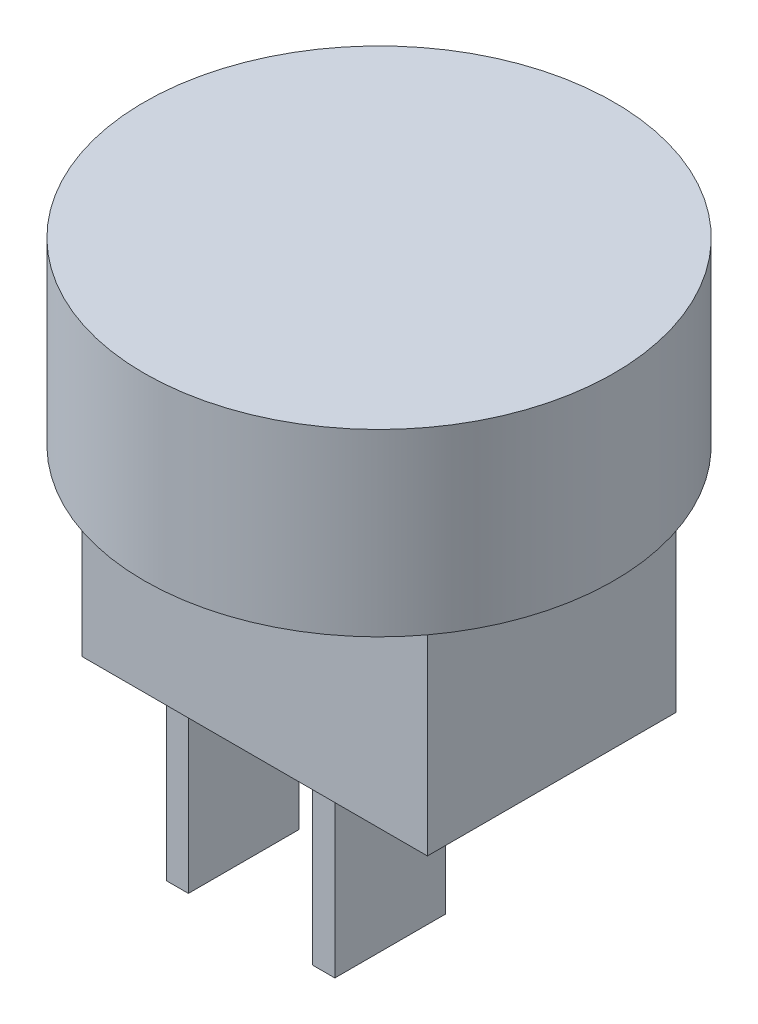
ISO-10303-21;
HEADER;
FILE_DESCRIPTION(('STEP AP214'),'2;1');
FILE_NAME('part.step','',(''),(''),'','','');
FILE_SCHEMA(('AUTOMOTIVE_DESIGN { 1 0 10303 214 1 1 1 1 }'));
ENDSEC;
DATA;
#1=APPLICATION_CONTEXT('core data for automotive mechanical design processes');
#2=APPLICATION_PROTOCOL_DEFINITION('international standard','automotive_design',2000,#1);
#3=PRODUCT_CONTEXT('',#1,'mechanical');
#4=PRODUCT('Part','Part','',(#3));
#5=PRODUCT_RELATED_PRODUCT_CATEGORY('part','',(#4));
#6=PRODUCT_DEFINITION_FORMATION('','',#4);
#7=PRODUCT_DEFINITION_CONTEXT('part definition',#1,'design');
#8=PRODUCT_DEFINITION('design','',#6,#7);
#9=PRODUCT_DEFINITION_SHAPE('','',#8);
#10=(LENGTH_UNIT() NAMED_UNIT(*) SI_UNIT(.MILLI.,.METRE.));
#11=(NAMED_UNIT(*) PLANE_ANGLE_UNIT() SI_UNIT($,.RADIAN.));
#12=(NAMED_UNIT(*) SI_UNIT($,.STERADIAN.) SOLID_ANGLE_UNIT());
#13=UNCERTAINTY_MEASURE_WITH_UNIT(LENGTH_MEASURE(1.E-05),#10,'distance_accuracy_value','');
#14=(GEOMETRIC_REPRESENTATION_CONTEXT(3) GLOBAL_UNCERTAINTY_ASSIGNED_CONTEXT((#13)) GLOBAL_UNIT_ASSIGNED_CONTEXT((#10,
#11,#12)) REPRESENTATION_CONTEXT('',''));
#15=CARTESIAN_POINT('',(0.,0.,0.));
#16=DIRECTION('',(0.,0.,1.));
#17=DIRECTION('',(1.,0.,0.));
#18=AXIS2_PLACEMENT_3D('',#15,#16,#17);
#19=CARTESIAN_POINT('',(0.,0.,0.));
#20=DIRECTION('',(0.,1.,0.));
#21=DIRECTION('',(0.,0.,1.));
#22=AXIS2_PLACEMENT_3D('',#19,#20,#21);
#23=PLANE('',#22);
#24=DIRECTION('',(0.,0.,1.));
#25=VECTOR('',#24,1.);
#26=CARTESIAN_POINT('',(0.4,0.,2.));
#27=LINE('',#26,#25);
#28=CARTESIAN_POINT('',(0.4,0.,-2.));
#29=VERTEX_POINT('',#28);
#30=CARTESIAN_POINT('',(0.4,0.,2.));
#31=VERTEX_POINT('',#30);
#32=EDGE_CURVE('E153',#29,#31,#27,.T.);
#33=ORIENTED_EDGE('',*,*,#32,.F.);
#34=DIRECTION('',(1.,0.,0.));
#35=VECTOR('',#34,1.);
#36=CARTESIAN_POINT('',(-0.4,0.,-2.));
#37=LINE('',#36,#35);
#38=CARTESIAN_POINT('',(-0.4,0.,-2.));
#39=VERTEX_POINT('',#38);
#40=EDGE_CURVE('E169',#39,#29,#37,.T.);
#41=ORIENTED_EDGE('',*,*,#40,.F.);
#42=DIRECTION('',(0.,0.,-1.));
#43=VECTOR('',#42,1.);
#44=CARTESIAN_POINT('',(-0.4,0.,2.));
#45=LINE('',#44,#43);
#46=CARTESIAN_POINT('',(-0.4,0.,2.));
#47=VERTEX_POINT('',#46);
#48=EDGE_CURVE('E182',#47,#39,#45,.T.);
#49=ORIENTED_EDGE('',*,*,#48,.F.);
#50=DIRECTION('',(-1.,0.,0.));
#51=VECTOR('',#50,1.);
#52=CARTESIAN_POINT('',(-0.4,0.,2.));
#53=LINE('',#52,#51);
#54=EDGE_CURVE('E158',#31,#47,#53,.T.);
#55=ORIENTED_EDGE('',*,*,#54,.F.);
#56=EDGE_LOOP('',(#33,#41,#49,#55));
#57=FACE_BOUND('',#56,.T.);
#58=DIRECTION('',(0.,0.,-1.));
#59=VECTOR('',#58,1.);
#60=CARTESIAN_POINT('',(6.25,0.,-4.5));
#61=LINE('',#60,#59);
#62=CARTESIAN_POINT('',(6.25,0.,4.5));
#63=VERTEX_POINT('',#62);
#64=CARTESIAN_POINT('',(6.25,0.,-4.5));
#65=VERTEX_POINT('',#64);
#66=EDGE_CURVE('E209',#63,#65,#61,.T.);
#67=ORIENTED_EDGE('',*,*,#66,.F.);
#68=DIRECTION('',(1.,0.,0.));
#69=VECTOR('',#68,1.);
#70=CARTESIAN_POINT('',(-6.25,0.,4.5));
#71=LINE('',#70,#69);
#72=CARTESIAN_POINT('',(-6.25,0.,4.5));
#73=VERTEX_POINT('',#72);
#74=EDGE_CURVE('E218',#73,#63,#71,.T.);
#75=ORIENTED_EDGE('',*,*,#74,.F.);
#76=DIRECTION('',(0.,0.,1.));
#77=VECTOR('',#76,1.);
#78=CARTESIAN_POINT('',(-6.25,0.,-4.5));
#79=LINE('',#78,#77);
#80=CARTESIAN_POINT('',(-6.25,0.,-4.5));
#81=VERTEX_POINT('',#80);
#82=EDGE_CURVE('E237',#81,#73,#79,.T.);
#83=ORIENTED_EDGE('',*,*,#82,.F.);
#84=DIRECTION('',(-1.,0.,0.));
#85=VECTOR('',#84,1.);
#86=CARTESIAN_POINT('',(-6.25,0.,-4.5));
#87=LINE('',#86,#85);
#88=EDGE_CURVE('E234',#65,#81,#87,.T.);
#89=ORIENTED_EDGE('',*,*,#88,.F.);
#90=EDGE_LOOP('',(#67,#75,#83,#89));
#91=FACE_BOUND('',#90,.T.);
#92=DIRECTION('',(0.,0.,1.));
#93=VECTOR('',#92,1.);
#94=CARTESIAN_POINT('',(-4.9,0.,2.));
#95=LINE('',#94,#93);
#96=CARTESIAN_POINT('',(-4.9,0.,-2.));
#97=VERTEX_POINT('',#96);
#98=CARTESIAN_POINT('',(-4.9,0.,2.));
#99=VERTEX_POINT('',#98);
#100=EDGE_CURVE('E151',#97,#99,#95,.T.);
#101=ORIENTED_EDGE('',*,*,#100,.F.);
#102=DIRECTION('',(1.,0.,0.));
#103=VECTOR('',#102,1.);
#104=CARTESIAN_POINT('',(-5.7,0.,-2.));
#105=LINE('',#104,#103);
#106=CARTESIAN_POINT('',(-5.7,0.,-2.));
#107=VERTEX_POINT('',#106);
#108=EDGE_CURVE('E148',#107,#97,#105,.T.);
#109=ORIENTED_EDGE('',*,*,#108,.F.);
#110=DIRECTION('',(0.,0.,-1.));
#111=VECTOR('',#110,1.);
#112=CARTESIAN_POINT('',(-5.7,0.,2.));
#113=LINE('',#112,#111);
#114=CARTESIAN_POINT('',(-5.7,0.,2.));
#115=VERTEX_POINT('',#114);
#116=EDGE_CURVE('E60',#115,#107,#113,.T.);
#117=ORIENTED_EDGE('',*,*,#116,.F.);
#118=DIRECTION('',(-1.,0.,0.));
#119=VECTOR('',#118,1.);
#120=CARTESIAN_POINT('',(-5.7,0.,2.));
#121=LINE('',#120,#119);
#122=EDGE_CURVE('E55',#99,#115,#121,.T.);
#123=ORIENTED_EDGE('',*,*,#122,.F.);
#124=EDGE_LOOP('',(#101,#109,#117,#123));
#125=FACE_BOUND('',#124,.T.);
#126=ADVANCED_FACE('F39',(#57,#91,#125),#23,.F.);
#127=CARTESIAN_POINT('',(6.25,7.5,-4.5));
#128=DIRECTION('',(-1.,0.,0.));
#129=DIRECTION('',(0.,0.,1.));
#130=AXIS2_PLACEMENT_3D('',#127,#128,#129);
#131=PLANE('',#130);
#132=ORIENTED_EDGE('',*,*,#66,.T.);
#133=DIRECTION('',(0.,-1.,0.));
#134=VECTOR('',#133,1.);
#135=CARTESIAN_POINT('',(6.25,7.5,-4.5));
#136=LINE('',#135,#134);
#137=CARTESIAN_POINT('',(6.25,7.5,-4.5));
#138=VERTEX_POINT('',#137);
#139=EDGE_CURVE('E11',#138,#65,#136,.T.);
#140=ORIENTED_EDGE('',*,*,#139,.F.);
#141=DIRECTION('',(0.,0.,-1.));
#142=VECTOR('',#141,1.);
#143=CARTESIAN_POINT('',(6.25,7.5,-4.5));
#144=LINE('',#143,#142);
#145=CARTESIAN_POINT('',(6.25,7.5,4.5));
#146=VERTEX_POINT('',#145);
#147=EDGE_CURVE('E213',#146,#138,#144,.T.);
#148=ORIENTED_EDGE('',*,*,#147,.F.);
#149=DIRECTION('',(0.,-1.,0.));
#150=VECTOR('',#149,1.);
#151=CARTESIAN_POINT('',(6.25,7.5,4.5));
#152=LINE('',#151,#150);
#153=EDGE_CURVE('E230',#146,#63,#152,.T.);
#154=ORIENTED_EDGE('',*,*,#153,.T.);
#155=EDGE_LOOP('',(#132,#140,#148,#154));
#156=FACE_BOUND('',#155,.T.);
#157=ADVANCED_FACE('F41',(#156),#131,.F.);
#158=CARTESIAN_POINT('',(-6.25,7.5,-4.5));
#159=DIRECTION('',(0.,0.,1.));
#160=DIRECTION('',(1.,0.,0.));
#161=AXIS2_PLACEMENT_3D('',#158,#159,#160);
#162=PLANE('',#161);
#163=ORIENTED_EDGE('',*,*,#88,.T.);
#164=DIRECTION('',(0.,-1.,0.));
#165=VECTOR('',#164,1.);
#166=CARTESIAN_POINT('',(-6.25,7.5,-4.5));
#167=LINE('',#166,#165);
#168=CARTESIAN_POINT('',(-6.25,7.5,-4.5));
#169=VERTEX_POINT('',#168);
#170=EDGE_CURVE('E48',#169,#81,#167,.T.);
#171=ORIENTED_EDGE('',*,*,#170,.F.);
#172=DIRECTION('',(-1.,0.,0.));
#173=VECTOR('',#172,1.);
#174=CARTESIAN_POINT('',(-6.25,7.5,-4.5));
#175=LINE('',#174,#173);
#176=EDGE_CURVE('E217',#138,#169,#175,.T.);
#177=ORIENTED_EDGE('',*,*,#176,.F.);
#178=ORIENTED_EDGE('',*,*,#139,.T.);
#179=EDGE_LOOP('',(#163,#171,#177,#178));
#180=FACE_BOUND('',#179,.T.);
#181=ADVANCED_FACE('F266',(#180),#162,.F.);
#182=CARTESIAN_POINT('',(-6.25,7.5,-4.5));
#183=DIRECTION('',(1.,0.,0.));
#184=DIRECTION('',(0.,0.,-1.));
#185=AXIS2_PLACEMENT_3D('',#182,#183,#184);
#186=PLANE('',#185);
#187=ORIENTED_EDGE('',*,*,#82,.T.);
#188=DIRECTION('',(0.,-1.,0.));
#189=VECTOR('',#188,1.);
#190=CARTESIAN_POINT('',(-6.25,7.5,4.5));
#191=LINE('',#190,#189);
#192=CARTESIAN_POINT('',(-6.25,7.5,4.5));
#193=VERTEX_POINT('',#192);
#194=EDGE_CURVE('E245',#193,#73,#191,.T.);
#195=ORIENTED_EDGE('',*,*,#194,.F.);
#196=DIRECTION('',(0.,0.,1.));
#197=VECTOR('',#196,1.);
#198=CARTESIAN_POINT('',(-6.25,7.5,-4.5));
#199=LINE('',#198,#197);
#200=EDGE_CURVE('E222',#169,#193,#199,.T.);
#201=ORIENTED_EDGE('',*,*,#200,.F.);
#202=ORIENTED_EDGE('',*,*,#170,.T.);
#203=EDGE_LOOP('',(#187,#195,#201,#202));
#204=FACE_BOUND('',#203,.T.);
#205=ADVANCED_FACE('F253',(#204),#186,.F.);
#206=CARTESIAN_POINT('',(-6.25,7.5,4.5));
#207=DIRECTION('',(0.,0.,-1.));
#208=DIRECTION('',(-1.,0.,0.));
#209=AXIS2_PLACEMENT_3D('',#206,#207,#208);
#210=PLANE('',#209);
#211=ORIENTED_EDGE('',*,*,#74,.T.);
#212=ORIENTED_EDGE('',*,*,#153,.F.);
#213=DIRECTION('',(1.,0.,0.));
#214=VECTOR('',#213,1.);
#215=CARTESIAN_POINT('',(-6.25,7.5,4.5));
#216=LINE('',#215,#214);
#217=EDGE_CURVE('E226',#193,#146,#216,.T.);
#218=ORIENTED_EDGE('',*,*,#217,.F.);
#219=ORIENTED_EDGE('',*,*,#194,.T.);
#220=EDGE_LOOP('',(#211,#212,#218,#219));
#221=FACE_BOUND('',#220,.T.);
#222=ADVANCED_FACE('F260',(#221),#210,.F.);
#223=CARTESIAN_POINT('',(0.,7.5,0.));
#224=DIRECTION('',(0.,1.,0.));
#225=DIRECTION('',(0.,0.,1.));
#226=AXIS2_PLACEMENT_3D('',#223,#224,#225);
#227=PLANE('',#226);
#228=CARTESIAN_POINT('',(0.,7.5,0.));
#229=DIRECTION('',(0.,1.,0.));
#230=DIRECTION('',(0.,0.,1.));
#231=AXIS2_PLACEMENT_3D('',#228,#229,#230);
#232=CIRCLE('',#231,8.5);
#233=CARTESIAN_POINT('',(0.,7.5,8.5));
#234=VERTEX_POINT('',#233);
#235=EDGE_CURVE('E204',#234,#234,#232,.T.);
#236=ORIENTED_EDGE('',*,*,#235,.F.);
#237=EDGE_LOOP('',(#236));
#238=FACE_BOUND('',#237,.T.);
#239=ORIENTED_EDGE('',*,*,#217,.T.);
#240=ORIENTED_EDGE('',*,*,#147,.T.);
#241=ORIENTED_EDGE('',*,*,#176,.T.);
#242=ORIENTED_EDGE('',*,*,#200,.T.);
#243=EDGE_LOOP('',(#239,#240,#241,#242));
#244=FACE_BOUND('',#243,.T.);
#245=ADVANCED_FACE('F265',(#238,#244),#227,.F.);
#246=CARTESIAN_POINT('',(0.,14.,0.));
#247=DIRECTION('',(0.,-1.,0.));
#248=DIRECTION('',(0.,0.,-1.));
#249=AXIS2_PLACEMENT_3D('',#246,#247,#248);
#250=CYLINDRICAL_SURFACE('',#249,8.5);
#251=CARTESIAN_POINT('',(0.,14.,0.));
#252=DIRECTION('',(0.,1.,0.));
#253=DIRECTION('',(0.,0.,1.));
#254=AXIS2_PLACEMENT_3D('',#251,#252,#253);
#255=CIRCLE('',#254,8.5);
#256=CARTESIAN_POINT('',(0.,14.,8.5));
#257=VERTEX_POINT('',#256);
#258=EDGE_CURVE('E205',#257,#257,#255,.T.);
#259=ORIENTED_EDGE('',*,*,#258,.F.);
#260=EDGE_LOOP('',(#259));
#261=FACE_BOUND('',#260,.T.);
#262=ORIENTED_EDGE('',*,*,#235,.T.);
#263=EDGE_LOOP('',(#262));
#264=FACE_BOUND('',#263,.T.);
#265=ADVANCED_FACE('F280',(#261,#264),#250,.T.);
#266=CARTESIAN_POINT('',(0.,14.,0.));
#267=DIRECTION('',(0.,1.,0.));
#268=DIRECTION('',(0.,0.,1.));
#269=AXIS2_PLACEMENT_3D('',#266,#267,#268);
#270=PLANE('',#269);
#271=ORIENTED_EDGE('',*,*,#258,.T.);
#272=EDGE_LOOP('',(#271));
#273=FACE_BOUND('',#272,.T.);
#274=ADVANCED_FACE('F290',(#273),#270,.T.);
#275=CARTESIAN_POINT('',(0.4,-8.,2.));
#276=DIRECTION('',(-1.,0.,0.));
#277=DIRECTION('',(0.,0.,1.));
#278=AXIS2_PLACEMENT_3D('',#275,#276,#277);
#279=PLANE('',#278);
#280=ORIENTED_EDGE('',*,*,#32,.T.);
#281=DIRECTION('',(0.,1.,0.));
#282=VECTOR('',#281,1.);
#283=CARTESIAN_POINT('',(0.4,-8.,2.));
#284=LINE('',#283,#282);
#285=CARTESIAN_POINT('',(0.4,-8.,2.));
#286=VERTEX_POINT('',#285);
#287=EDGE_CURVE('E200',#286,#31,#284,.T.);
#288=ORIENTED_EDGE('',*,*,#287,.F.);
#289=DIRECTION('',(0.,0.,1.));
#290=VECTOR('',#289,1.);
#291=CARTESIAN_POINT('',(0.4,-8.,2.));
#292=LINE('',#291,#290);
#293=CARTESIAN_POINT('',(0.4,-8.,-2.));
#294=VERTEX_POINT('',#293);
#295=EDGE_CURVE('E164',#294,#286,#292,.T.);
#296=ORIENTED_EDGE('',*,*,#295,.F.);
#297=DIRECTION('',(0.,1.,0.));
#298=VECTOR('',#297,1.);
#299=CARTESIAN_POINT('',(0.4,-8.,-2.));
#300=LINE('',#299,#298);
#301=EDGE_CURVE('E177',#294,#29,#300,.T.);
#302=ORIENTED_EDGE('',*,*,#301,.T.);
#303=EDGE_LOOP('',(#280,#288,#296,#302));
#304=FACE_BOUND('',#303,.T.);
#305=ADVANCED_FACE('F296',(#304),#279,.F.);
#306=CARTESIAN_POINT('',(-0.4,-8.,2.));
#307=DIRECTION('',(0.,0.,-1.));
#308=DIRECTION('',(-1.,0.,0.));
#309=AXIS2_PLACEMENT_3D('',#306,#307,#308);
#310=PLANE('',#309);
#311=ORIENTED_EDGE('',*,*,#54,.T.);
#312=DIRECTION('',(0.,1.,0.));
#313=VECTOR('',#312,1.);
#314=CARTESIAN_POINT('',(-0.4,-8.,2.));
#315=LINE('',#314,#313);
#316=CARTESIAN_POINT('',(-0.4,-8.,2.));
#317=VERTEX_POINT('',#316);
#318=EDGE_CURVE('E196',#317,#47,#315,.T.);
#319=ORIENTED_EDGE('',*,*,#318,.F.);
#320=DIRECTION('',(-1.,0.,0.));
#321=VECTOR('',#320,1.);
#322=CARTESIAN_POINT('',(-0.4,-8.,2.));
#323=LINE('',#322,#321);
#324=EDGE_CURVE('E168',#286,#317,#323,.T.);
#325=ORIENTED_EDGE('',*,*,#324,.F.);
#326=ORIENTED_EDGE('',*,*,#287,.T.);
#327=EDGE_LOOP('',(#311,#319,#325,#326));
#328=FACE_BOUND('',#327,.T.);
#329=ADVANCED_FACE('F300',(#328),#310,.F.);
#330=CARTESIAN_POINT('',(-0.4,-8.,2.));
#331=DIRECTION('',(1.,0.,0.));
#332=DIRECTION('',(0.,0.,-1.));
#333=AXIS2_PLACEMENT_3D('',#330,#331,#332);
#334=PLANE('',#333);
#335=ORIENTED_EDGE('',*,*,#48,.T.);
#336=DIRECTION('',(0.,1.,0.));
#337=VECTOR('',#336,1.);
#338=CARTESIAN_POINT('',(-0.4,-8.,-2.));
#339=LINE('',#338,#337);
#340=CARTESIAN_POINT('',(-0.4,-8.,-2.));
#341=VERTEX_POINT('',#340);
#342=EDGE_CURVE('E192',#341,#39,#339,.T.);
#343=ORIENTED_EDGE('',*,*,#342,.F.);
#344=DIRECTION('',(0.,0.,-1.));
#345=VECTOR('',#344,1.);
#346=CARTESIAN_POINT('',(-0.4,-8.,2.));
#347=LINE('',#346,#345);
#348=EDGE_CURVE('E172',#317,#341,#347,.T.);
#349=ORIENTED_EDGE('',*,*,#348,.F.);
#350=ORIENTED_EDGE('',*,*,#318,.T.);
#351=EDGE_LOOP('',(#335,#343,#349,#350));
#352=FACE_BOUND('',#351,.T.);
#353=ADVANCED_FACE('F304',(#352),#334,.F.);
#354=CARTESIAN_POINT('',(-0.4,-8.,-2.));
#355=DIRECTION('',(0.,0.,1.));
#356=DIRECTION('',(1.,0.,0.));
#357=AXIS2_PLACEMENT_3D('',#354,#355,#356);
#358=PLANE('',#357);
#359=ORIENTED_EDGE('',*,*,#40,.T.);
#360=ORIENTED_EDGE('',*,*,#301,.F.);
#361=DIRECTION('',(1.,0.,0.));
#362=VECTOR('',#361,1.);
#363=CARTESIAN_POINT('',(-0.4,-8.,-2.));
#364=LINE('',#363,#362);
#365=EDGE_CURVE('E175',#341,#294,#364,.T.);
#366=ORIENTED_EDGE('',*,*,#365,.F.);
#367=ORIENTED_EDGE('',*,*,#342,.T.);
#368=EDGE_LOOP('',(#359,#360,#366,#367));
#369=FACE_BOUND('',#368,.T.);
#370=ADVANCED_FACE('F308',(#369),#358,.F.);
#371=CARTESIAN_POINT('',(0.,-8.,0.));
#372=DIRECTION('',(0.,-1.,0.));
#373=DIRECTION('',(0.,0.,-1.));
#374=AXIS2_PLACEMENT_3D('',#371,#372,#373);
#375=PLANE('',#374);
#376=ORIENTED_EDGE('',*,*,#295,.T.);
#377=ORIENTED_EDGE('',*,*,#324,.T.);
#378=ORIENTED_EDGE('',*,*,#348,.T.);
#379=ORIENTED_EDGE('',*,*,#365,.T.);
#380=EDGE_LOOP('',(#376,#377,#378,#379));
#381=FACE_BOUND('',#380,.T.);
#382=ADVANCED_FACE('F312',(#381),#375,.T.);
#383=CARTESIAN_POINT('',(-4.9,-8.,2.));
#384=DIRECTION('',(-1.,0.,0.));
#385=DIRECTION('',(0.,0.,1.));
#386=AXIS2_PLACEMENT_3D('',#383,#384,#385);
#387=PLANE('',#386);
#388=ORIENTED_EDGE('',*,*,#100,.T.);
#389=DIRECTION('',(0.,1.,0.));
#390=VECTOR('',#389,1.);
#391=CARTESIAN_POINT('',(-4.9,-8.,2.));
#392=LINE('',#391,#390);
#393=CARTESIAN_POINT('',(-4.9,-8.,2.));
#394=VERTEX_POINT('',#393);
#395=EDGE_CURVE('E130',#394,#99,#392,.T.);
#396=ORIENTED_EDGE('',*,*,#395,.F.);
#397=DIRECTION('',(0.,0.,1.));
#398=VECTOR('',#397,1.);
#399=CARTESIAN_POINT('',(-4.9,-8.,2.));
#400=LINE('',#399,#398);
#401=CARTESIAN_POINT('',(-4.9,-8.,-2.));
#402=VERTEX_POINT('',#401);
#403=EDGE_CURVE('E138',#402,#394,#400,.T.);
#404=ORIENTED_EDGE('',*,*,#403,.F.);
#405=DIRECTION('',(0.,1.,0.));
#406=VECTOR('',#405,1.);
#407=CARTESIAN_POINT('',(-4.9,-8.,-2.));
#408=LINE('',#407,#406);
#409=EDGE_CURVE('E432',#402,#97,#408,.T.);
#410=ORIENTED_EDGE('',*,*,#409,.T.);
#411=EDGE_LOOP('',(#388,#396,#404,#410));
#412=FACE_BOUND('',#411,.T.);
#413=ADVANCED_FACE('F150',(#412),#387,.F.);
#414=CARTESIAN_POINT('',(-5.7,-8.,2.));
#415=DIRECTION('',(0.,0.,-1.));
#416=DIRECTION('',(-1.,0.,0.));
#417=AXIS2_PLACEMENT_3D('',#414,#415,#416);
#418=PLANE('',#417);
#419=ORIENTED_EDGE('',*,*,#122,.T.);
#420=DIRECTION('',(0.,1.,0.));
#421=VECTOR('',#420,1.);
#422=CARTESIAN_POINT('',(-5.7,-8.,2.));
#423=LINE('',#422,#421);
#424=CARTESIAN_POINT('',(-5.7,-8.,2.));
#425=VERTEX_POINT('',#424);
#426=EDGE_CURVE('E133',#425,#115,#423,.T.);
#427=ORIENTED_EDGE('',*,*,#426,.F.);
#428=DIRECTION('',(-1.,0.,0.));
#429=VECTOR('',#428,1.);
#430=CARTESIAN_POINT('',(-5.7,-8.,2.));
#431=LINE('',#430,#429);
#432=EDGE_CURVE('E126',#394,#425,#431,.T.);
#433=ORIENTED_EDGE('',*,*,#432,.F.);
#434=ORIENTED_EDGE('',*,*,#395,.T.);
#435=EDGE_LOOP('',(#419,#427,#433,#434));
#436=FACE_BOUND('',#435,.T.);
#437=ADVANCED_FACE('F128',(#436),#418,.F.);
#438=CARTESIAN_POINT('',(-5.7,-8.,2.));
#439=DIRECTION('',(1.,0.,0.));
#440=DIRECTION('',(0.,0.,-1.));
#441=AXIS2_PLACEMENT_3D('',#438,#439,#440);
#442=PLANE('',#441);
#443=ORIENTED_EDGE('',*,*,#116,.T.);
#444=DIRECTION('',(0.,1.,0.));
#445=VECTOR('',#444,1.);
#446=CARTESIAN_POINT('',(-5.7,-8.,-2.));
#447=LINE('',#446,#445);
#448=CARTESIAN_POINT('',(-5.7,-8.,-2.));
#449=VERTEX_POINT('',#448);
#450=EDGE_CURVE('E160',#449,#107,#447,.T.);
#451=ORIENTED_EDGE('',*,*,#450,.F.);
#452=DIRECTION('',(0.,0.,-1.));
#453=VECTOR('',#452,1.);
#454=CARTESIAN_POINT('',(-5.7,-8.,2.));
#455=LINE('',#454,#453);
#456=EDGE_CURVE('E137',#425,#449,#455,.T.);
#457=ORIENTED_EDGE('',*,*,#456,.F.);
#458=ORIENTED_EDGE('',*,*,#426,.T.);
#459=EDGE_LOOP('',(#443,#451,#457,#458));
#460=FACE_BOUND('',#459,.T.);
#461=ADVANCED_FACE('F321',(#460),#442,.F.);
#462=CARTESIAN_POINT('',(-5.7,-8.,-2.));
#463=DIRECTION('',(0.,0.,1.));
#464=DIRECTION('',(1.,0.,0.));
#465=AXIS2_PLACEMENT_3D('',#462,#463,#464);
#466=PLANE('',#465);
#467=ORIENTED_EDGE('',*,*,#108,.T.);
#468=ORIENTED_EDGE('',*,*,#409,.F.);
#469=DIRECTION('',(1.,0.,0.));
#470=VECTOR('',#469,1.);
#471=CARTESIAN_POINT('',(-5.7,-8.,-2.));
#472=LINE('',#471,#470);
#473=EDGE_CURVE('E143',#449,#402,#472,.T.);
#474=ORIENTED_EDGE('',*,*,#473,.F.);
#475=ORIENTED_EDGE('',*,*,#450,.T.);
#476=EDGE_LOOP('',(#467,#468,#474,#475));
#477=FACE_BOUND('',#476,.T.);
#478=ADVANCED_FACE('F324',(#477),#466,.F.);
#479=CARTESIAN_POINT('',(0.,-8.,0.));
#480=DIRECTION('',(0.,-1.,0.));
#481=DIRECTION('',(0.,0.,-1.));
#482=AXIS2_PLACEMENT_3D('',#479,#480,#481);
#483=PLANE('',#482);
#484=ORIENTED_EDGE('',*,*,#403,.T.);
#485=ORIENTED_EDGE('',*,*,#432,.T.);
#486=ORIENTED_EDGE('',*,*,#456,.T.);
#487=ORIENTED_EDGE('',*,*,#473,.T.);
#488=EDGE_LOOP('',(#484,#485,#486,#487));
#489=FACE_BOUND('',#488,.T.);
#490=ADVANCED_FACE('F141',(#489),#483,.T.);
#491=CLOSED_SHELL('',(#126,#157,#181,#205,#222,#245,#265,#274,#305,#329,#353,#370,#382,#413,
#437,#461,#478,#490));
#492=MANIFOLD_SOLID_BREP('B2',#491);
#493=ADVANCED_BREP_SHAPE_REPRESENTATION('',(#18,#492),#14);
#494=SHAPE_DEFINITION_REPRESENTATION(#9,#493);
ENDSEC;
END-ISO-10303-21;
